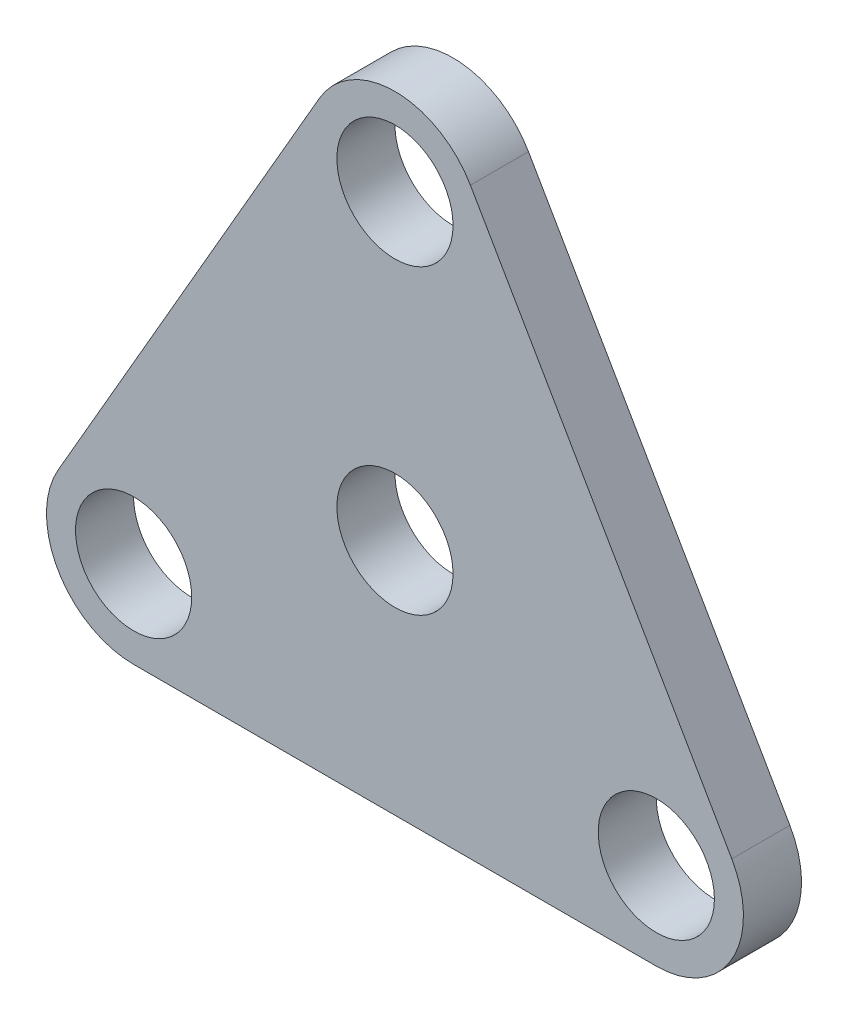
ISO-10303-21;
HEADER;
FILE_DESCRIPTION(('STEP AP214'),'2;1');
FILE_NAME('part.step','',(''),(''),'','','');
FILE_SCHEMA(('AUTOMOTIVE_DESIGN { 1 0 10303 214 1 1 1 1 }'));
ENDSEC;
DATA;
#1=APPLICATION_CONTEXT('core data for automotive mechanical design processes');
#2=APPLICATION_PROTOCOL_DEFINITION('international standard','automotive_design',2000,#1);
#3=PRODUCT_CONTEXT('',#1,'mechanical');
#4=PRODUCT('Part','Part','',(#3));
#5=PRODUCT_RELATED_PRODUCT_CATEGORY('part','',(#4));
#6=PRODUCT_DEFINITION_FORMATION('','',#4);
#7=PRODUCT_DEFINITION_CONTEXT('part definition',#1,'design');
#8=PRODUCT_DEFINITION('design','',#6,#7);
#9=PRODUCT_DEFINITION_SHAPE('','',#8);
#10=(LENGTH_UNIT() NAMED_UNIT(*) SI_UNIT(.MILLI.,.METRE.));
#11=(NAMED_UNIT(*) PLANE_ANGLE_UNIT() SI_UNIT($,.RADIAN.));
#12=(NAMED_UNIT(*) SI_UNIT($,.STERADIAN.) SOLID_ANGLE_UNIT());
#13=UNCERTAINTY_MEASURE_WITH_UNIT(LENGTH_MEASURE(1.E-05),#10,'distance_accuracy_value','');
#14=(GEOMETRIC_REPRESENTATION_CONTEXT(3) GLOBAL_UNCERTAINTY_ASSIGNED_CONTEXT((#13)) GLOBAL_UNIT_ASSIGNED_CONTEXT((#10,
#11,#12)) REPRESENTATION_CONTEXT('',''));
#15=CARTESIAN_POINT('',(0.,0.,0.));
#16=DIRECTION('',(0.,0.,1.));
#17=DIRECTION('',(1.,0.,0.));
#18=AXIS2_PLACEMENT_3D('',#15,#16,#17);
#19=CARTESIAN_POINT('',(0.,32.9955678841871,6.35));
#20=DIRECTION('',(0.,0.,1.));
#21=DIRECTION('',(1.,0.,0.));
#22=AXIS2_PLACEMENT_3D('',#19,#20,#21);
#23=PLANE('',#22);
#24=CARTESIAN_POINT('',(0.,32.9955678841871,6.35));
#25=DIRECTION('',(0.,0.,1.));
#26=DIRECTION('',(1.,0.,0.));
#27=AXIS2_PLACEMENT_3D('',#24,#25,#26);
#28=CIRCLE('',#27,6.35);
#29=CARTESIAN_POINT('',(6.35000000000001,32.9955678841871,6.35));
#30=VERTEX_POINT('',#29);
#31=EDGE_CURVE('E191',#30,#30,#28,.T.);
#32=ORIENTED_EDGE('',*,*,#31,.F.);
#33=EDGE_LOOP('',(#32));
#34=FACE_BOUND('',#33,.T.);
#35=CARTESIAN_POINT('',(0.,0.,6.35));
#36=DIRECTION('',(0.,0.,1.));
#37=DIRECTION('',(1.,0.,0.));
#38=AXIS2_PLACEMENT_3D('',#35,#36,#37);
#39=CIRCLE('',#38,6.35);
#40=CARTESIAN_POINT('',(6.35,0.,6.35));
#41=VERTEX_POINT('',#40);
#42=EDGE_CURVE('E124',#41,#41,#39,.T.);
#43=ORIENTED_EDGE('',*,*,#42,.F.);
#44=EDGE_LOOP('',(#43));
#45=FACE_BOUND('',#44,.T.);
#46=CARTESIAN_POINT('',(0.,32.9955678841871,6.35));
#47=DIRECTION('',(0.,0.,1.));
#48=DIRECTION('',(1.,0.,0.));
#49=AXIS2_PLACEMENT_3D('',#46,#47,#48);
#50=CIRCLE('',#49,9.525);
#51=CARTESIAN_POINT('',(8.24889197104678,37.7580678841871,6.35));
#52=VERTEX_POINT('',#51);
#53=CARTESIAN_POINT('',(-8.24889197104676,37.7580678841871,6.35));
#54=VERTEX_POINT('',#53);
#55=EDGE_CURVE('E131',#52,#54,#50,.T.);
#56=ORIENTED_EDGE('',*,*,#55,.T.);
#57=DIRECTION('',(-0.5,-0.866025403784439,0.));
#58=VECTOR('',#57,1.);
#59=CARTESIAN_POINT('',(-8.24889197104676,37.7580678841871,6.35));
#60=LINE('',#59,#58);
#61=CARTESIAN_POINT('',(-36.8238919710468,-11.7352839420936,6.35));
#62=VERTEX_POINT('',#61);
#63=EDGE_CURVE('E89',#54,#62,#60,.T.);
#64=ORIENTED_EDGE('',*,*,#63,.T.);
#65=CARTESIAN_POINT('',(-28.575,-16.4977839420936,6.35));
#66=DIRECTION('',(0.,0.,1.));
#67=DIRECTION('',(1.,0.,0.));
#68=AXIS2_PLACEMENT_3D('',#65,#66,#67);
#69=CIRCLE('',#68,9.525);
#70=CARTESIAN_POINT('',(-28.575,-26.0227839420936,6.35));
#71=VERTEX_POINT('',#70);
#72=EDGE_CURVE('E102',#62,#71,#69,.T.);
#73=ORIENTED_EDGE('',*,*,#72,.T.);
#74=DIRECTION('',(1.,0.,0.));
#75=VECTOR('',#74,1.);
#76=CARTESIAN_POINT('',(-28.575,-26.0227839420936,6.35));
#77=LINE('',#76,#75);
#78=CARTESIAN_POINT('',(28.575,-26.0227839420936,6.35));
#79=VERTEX_POINT('',#78);
#80=EDGE_CURVE('E96',#71,#79,#77,.T.);
#81=ORIENTED_EDGE('',*,*,#80,.T.);
#82=CARTESIAN_POINT('',(28.575,-16.4977839420936,6.35));
#83=DIRECTION('',(0.,0.,1.));
#84=DIRECTION('',(1.,0.,0.));
#85=AXIS2_PLACEMENT_3D('',#82,#83,#84);
#86=CIRCLE('',#85,9.525);
#87=CARTESIAN_POINT('',(36.8238919710468,-11.7352839420936,6.35));
#88=VERTEX_POINT('',#87);
#89=EDGE_CURVE('E100',#79,#88,#86,.T.);
#90=ORIENTED_EDGE('',*,*,#89,.T.);
#91=DIRECTION('',(-0.5,0.866025403784439,0.));
#92=VECTOR('',#91,1.);
#93=CARTESIAN_POINT('',(36.8238919710468,-11.7352839420936,6.35));
#94=LINE('',#93,#92);
#95=EDGE_CURVE('E52',#88,#52,#94,.T.);
#96=ORIENTED_EDGE('',*,*,#95,.T.);
#97=EDGE_LOOP('',(#56,#64,#73,#81,#90,#96));
#98=FACE_BOUND('',#97,.T.);
#99=CARTESIAN_POINT('',(-28.575,-16.4977839420936,6.35));
#100=DIRECTION('',(0.,0.,1.));
#101=DIRECTION('',(1.,0.,0.));
#102=AXIS2_PLACEMENT_3D('',#99,#100,#101);
#103=CIRCLE('',#102,6.35);
#104=CARTESIAN_POINT('',(-22.225,-16.4977839420936,6.35));
#105=VERTEX_POINT('',#104);
#106=EDGE_CURVE('E197',#105,#105,#103,.T.);
#107=ORIENTED_EDGE('',*,*,#106,.F.);
#108=EDGE_LOOP('',(#107));
#109=FACE_BOUND('',#108,.T.);
#110=CARTESIAN_POINT('',(28.575,-16.4977839420936,6.35));
#111=DIRECTION('',(0.,0.,1.));
#112=DIRECTION('',(1.,0.,0.));
#113=AXIS2_PLACEMENT_3D('',#110,#111,#112);
#114=CIRCLE('',#113,6.35);
#115=CARTESIAN_POINT('',(34.925,-16.4977839420936,6.35));
#116=VERTEX_POINT('',#115);
#117=EDGE_CURVE('E182',#116,#116,#114,.T.);
#118=ORIENTED_EDGE('',*,*,#117,.F.);
#119=EDGE_LOOP('',(#118));
#120=FACE_BOUND('',#119,.T.);
#121=ADVANCED_FACE('F35',(#34,#45,#98,#109,#120),#23,.T.);
#122=CARTESIAN_POINT('',(0.,32.9955678841871,0.));
#123=DIRECTION('',(0.,0.,1.));
#124=DIRECTION('',(1.,0.,0.));
#125=AXIS2_PLACEMENT_3D('',#122,#123,#124);
#126=PLANE('',#125);
#127=CARTESIAN_POINT('',(0.,32.9955678841871,0.));
#128=DIRECTION('',(0.,0.,1.));
#129=DIRECTION('',(1.,0.,0.));
#130=AXIS2_PLACEMENT_3D('',#127,#128,#129);
#131=CIRCLE('',#130,9.525);
#132=CARTESIAN_POINT('',(8.24889197104678,37.7580678841871,0.));
#133=VERTEX_POINT('',#132);
#134=CARTESIAN_POINT('',(-8.24889197104676,37.7580678841871,0.));
#135=VERTEX_POINT('',#134);
#136=EDGE_CURVE('E120',#133,#135,#131,.T.);
#137=ORIENTED_EDGE('',*,*,#136,.F.);
#138=DIRECTION('',(-0.5,0.866025403784439,0.));
#139=VECTOR('',#138,1.);
#140=CARTESIAN_POINT('',(36.8238919710468,-11.7352839420936,0.));
#141=LINE('',#140,#139);
#142=CARTESIAN_POINT('',(36.8238919710468,-11.7352839420936,0.));
#143=VERTEX_POINT('',#142);
#144=EDGE_CURVE('E81',#143,#133,#141,.T.);
#145=ORIENTED_EDGE('',*,*,#144,.F.);
#146=CARTESIAN_POINT('',(28.575,-16.4977839420936,0.));
#147=DIRECTION('',(0.,0.,1.));
#148=DIRECTION('',(1.,0.,0.));
#149=AXIS2_PLACEMENT_3D('',#146,#147,#148);
#150=CIRCLE('',#149,9.525);
#151=CARTESIAN_POINT('',(28.575,-26.0227839420936,0.));
#152=VERTEX_POINT('',#151);
#153=EDGE_CURVE('E75',#152,#143,#150,.T.);
#154=ORIENTED_EDGE('',*,*,#153,.F.);
#155=DIRECTION('',(1.,0.,0.));
#156=VECTOR('',#155,1.);
#157=CARTESIAN_POINT('',(-28.575,-26.0227839420936,0.));
#158=LINE('',#157,#156);
#159=CARTESIAN_POINT('',(-28.575,-26.0227839420936,0.));
#160=VERTEX_POINT('',#159);
#161=EDGE_CURVE('E110',#160,#152,#158,.T.);
#162=ORIENTED_EDGE('',*,*,#161,.F.);
#163=CARTESIAN_POINT('',(-28.575,-16.4977839420936,0.));
#164=DIRECTION('',(0.,0.,1.));
#165=DIRECTION('',(1.,0.,0.));
#166=AXIS2_PLACEMENT_3D('',#163,#164,#165);
#167=CIRCLE('',#166,9.525);
#168=CARTESIAN_POINT('',(-36.8238919710468,-11.7352839420936,0.));
#169=VERTEX_POINT('',#168);
#170=EDGE_CURVE('E126',#169,#160,#167,.T.);
#171=ORIENTED_EDGE('',*,*,#170,.F.);
#172=DIRECTION('',(-0.5,-0.866025403784439,0.));
#173=VECTOR('',#172,1.);
#174=CARTESIAN_POINT('',(-8.24889197104676,37.7580678841871,0.));
#175=LINE('',#174,#173);
#176=EDGE_CURVE('E123',#135,#169,#175,.T.);
#177=ORIENTED_EDGE('',*,*,#176,.F.);
#178=EDGE_LOOP('',(#137,#145,#154,#162,#171,#177));
#179=FACE_BOUND('',#178,.T.);
#180=CARTESIAN_POINT('',(0.,0.,0.));
#181=DIRECTION('',(0.,0.,1.));
#182=DIRECTION('',(1.,0.,0.));
#183=AXIS2_PLACEMENT_3D('',#180,#181,#182);
#184=CIRCLE('',#183,6.35);
#185=CARTESIAN_POINT('',(6.35,0.,0.));
#186=VERTEX_POINT('',#185);
#187=EDGE_CURVE('E200',#186,#186,#184,.T.);
#188=ORIENTED_EDGE('',*,*,#187,.T.);
#189=EDGE_LOOP('',(#188));
#190=FACE_BOUND('',#189,.T.);
#191=CARTESIAN_POINT('',(-28.575,-16.4977839420936,0.));
#192=DIRECTION('',(0.,0.,1.));
#193=DIRECTION('',(1.,0.,0.));
#194=AXIS2_PLACEMENT_3D('',#191,#192,#193);
#195=CIRCLE('',#194,6.35);
#196=CARTESIAN_POINT('',(-22.225,-16.4977839420936,0.));
#197=VERTEX_POINT('',#196);
#198=EDGE_CURVE('E194',#197,#197,#195,.T.);
#199=ORIENTED_EDGE('',*,*,#198,.T.);
#200=EDGE_LOOP('',(#199));
#201=FACE_BOUND('',#200,.T.);
#202=CARTESIAN_POINT('',(0.,32.9955678841871,0.));
#203=DIRECTION('',(0.,0.,1.));
#204=DIRECTION('',(1.,0.,0.));
#205=AXIS2_PLACEMENT_3D('',#202,#203,#204);
#206=CIRCLE('',#205,6.35);
#207=CARTESIAN_POINT('',(6.35000000000001,32.9955678841871,0.));
#208=VERTEX_POINT('',#207);
#209=EDGE_CURVE('E188',#208,#208,#206,.T.);
#210=ORIENTED_EDGE('',*,*,#209,.T.);
#211=EDGE_LOOP('',(#210));
#212=FACE_BOUND('',#211,.T.);
#213=CARTESIAN_POINT('',(28.575,-16.4977839420936,0.));
#214=DIRECTION('',(0.,0.,1.));
#215=DIRECTION('',(1.,0.,0.));
#216=AXIS2_PLACEMENT_3D('',#213,#214,#215);
#217=CIRCLE('',#216,6.35);
#218=CARTESIAN_POINT('',(34.925,-16.4977839420936,0.));
#219=VERTEX_POINT('',#218);
#220=EDGE_CURVE('E185',#219,#219,#217,.T.);
#221=ORIENTED_EDGE('',*,*,#220,.T.);
#222=EDGE_LOOP('',(#221));
#223=FACE_BOUND('',#222,.T.);
#224=ADVANCED_FACE('F140',(#179,#190,#201,#212,#223),#126,.F.);
#225=CARTESIAN_POINT('',(0.,32.9955678841871,6.35));
#226=DIRECTION('',(0.,0.,-1.));
#227=DIRECTION('',(-1.,0.,0.));
#228=AXIS2_PLACEMENT_3D('',#225,#226,#227);
#229=CYLINDRICAL_SURFACE('',#228,9.525);
#230=ORIENTED_EDGE('',*,*,#136,.T.);
#231=DIRECTION('',(0.,0.,-1.));
#232=VECTOR('',#231,1.);
#233=CARTESIAN_POINT('',(-8.24889197104676,37.7580678841871,6.35));
#234=LINE('',#233,#232);
#235=EDGE_CURVE('E11',#54,#135,#234,.T.);
#236=ORIENTED_EDGE('',*,*,#235,.F.);
#237=ORIENTED_EDGE('',*,*,#55,.F.);
#238=DIRECTION('',(0.,0.,-1.));
#239=VECTOR('',#238,1.);
#240=CARTESIAN_POINT('',(8.24889197104678,37.7580678841871,6.35));
#241=LINE('',#240,#239);
#242=EDGE_CURVE('E116',#52,#133,#241,.T.);
#243=ORIENTED_EDGE('',*,*,#242,.T.);
#244=EDGE_LOOP('',(#230,#236,#237,#243));
#245=FACE_BOUND('',#244,.T.);
#246=ADVANCED_FACE('F37',(#245),#229,.T.);
#247=CARTESIAN_POINT('',(-8.24889197104676,37.7580678841871,6.35));
#248=DIRECTION('',(0.866025403784439,-0.5,0.));
#249=DIRECTION('',(0.5,0.866025403784439,0.));
#250=AXIS2_PLACEMENT_3D('',#247,#248,#249);
#251=PLANE('',#250);
#252=ORIENTED_EDGE('',*,*,#176,.T.);
#253=DIRECTION('',(0.,0.,-1.));
#254=VECTOR('',#253,1.);
#255=CARTESIAN_POINT('',(-36.8238919710468,-11.7352839420936,6.35));
#256=LINE('',#255,#254);
#257=EDGE_CURVE('E44',#62,#169,#256,.T.);
#258=ORIENTED_EDGE('',*,*,#257,.F.);
#259=ORIENTED_EDGE('',*,*,#63,.F.);
#260=ORIENTED_EDGE('',*,*,#235,.T.);
#261=EDGE_LOOP('',(#252,#258,#259,#260));
#262=FACE_BOUND('',#261,.T.);
#263=ADVANCED_FACE('F258',(#262),#251,.F.);
#264=CARTESIAN_POINT('',(-28.575,-16.4977839420936,6.35));
#265=DIRECTION('',(0.,0.,-1.));
#266=DIRECTION('',(-1.,0.,0.));
#267=AXIS2_PLACEMENT_3D('',#264,#265,#266);
#268=CYLINDRICAL_SURFACE('',#267,9.525);
#269=ORIENTED_EDGE('',*,*,#170,.T.);
#270=DIRECTION('',(0.,0.,-1.));
#271=VECTOR('',#270,1.);
#272=CARTESIAN_POINT('',(-28.575,-26.0227839420936,6.35));
#273=LINE('',#272,#271);
#274=EDGE_CURVE('E111',#71,#160,#273,.T.);
#275=ORIENTED_EDGE('',*,*,#274,.F.);
#276=ORIENTED_EDGE('',*,*,#72,.F.);
#277=ORIENTED_EDGE('',*,*,#257,.T.);
#278=EDGE_LOOP('',(#269,#275,#276,#277));
#279=FACE_BOUND('',#278,.T.);
#280=ADVANCED_FACE('F137',(#279),#268,.T.);
#281=CARTESIAN_POINT('',(-28.575,-26.0227839420936,6.35));
#282=DIRECTION('',(0.,1.,0.));
#283=DIRECTION('',(-1.,0.,0.));
#284=AXIS2_PLACEMENT_3D('',#281,#282,#283);
#285=PLANE('',#284);
#286=ORIENTED_EDGE('',*,*,#161,.T.);
#287=DIRECTION('',(0.,0.,-1.));
#288=VECTOR('',#287,1.);
#289=CARTESIAN_POINT('',(28.575,-26.0227839420936,6.35));
#290=LINE('',#289,#288);
#291=EDGE_CURVE('E107',#79,#152,#290,.T.);
#292=ORIENTED_EDGE('',*,*,#291,.F.);
#293=ORIENTED_EDGE('',*,*,#80,.F.);
#294=ORIENTED_EDGE('',*,*,#274,.T.);
#295=EDGE_LOOP('',(#286,#292,#293,#294));
#296=FACE_BOUND('',#295,.T.);
#297=ADVANCED_FACE('F108',(#296),#285,.F.);
#298=CARTESIAN_POINT('',(28.575,-16.4977839420936,6.35));
#299=DIRECTION('',(0.,0.,-1.));
#300=DIRECTION('',(-1.,0.,0.));
#301=AXIS2_PLACEMENT_3D('',#298,#299,#300);
#302=CYLINDRICAL_SURFACE('',#301,9.525);
#303=ORIENTED_EDGE('',*,*,#153,.T.);
#304=DIRECTION('',(0.,0.,-1.));
#305=VECTOR('',#304,1.);
#306=CARTESIAN_POINT('',(36.8238919710468,-11.7352839420936,6.35));
#307=LINE('',#306,#305);
#308=EDGE_CURVE('E112',#88,#143,#307,.T.);
#309=ORIENTED_EDGE('',*,*,#308,.F.);
#310=ORIENTED_EDGE('',*,*,#89,.F.);
#311=ORIENTED_EDGE('',*,*,#291,.T.);
#312=EDGE_LOOP('',(#303,#309,#310,#311));
#313=FACE_BOUND('',#312,.T.);
#314=ADVANCED_FACE('F114',(#313),#302,.T.);
#315=CARTESIAN_POINT('',(36.8238919710468,-11.7352839420936,6.35));
#316=DIRECTION('',(-0.866025403784439,-0.5,0.));
#317=DIRECTION('',(0.5,-0.866025403784439,0.));
#318=AXIS2_PLACEMENT_3D('',#315,#316,#317);
#319=PLANE('',#318);
#320=ORIENTED_EDGE('',*,*,#144,.T.);
#321=ORIENTED_EDGE('',*,*,#242,.F.);
#322=ORIENTED_EDGE('',*,*,#95,.F.);
#323=ORIENTED_EDGE('',*,*,#308,.T.);
#324=EDGE_LOOP('',(#320,#321,#322,#323));
#325=FACE_BOUND('',#324,.T.);
#326=ADVANCED_FACE('F145',(#325),#319,.F.);
#327=CARTESIAN_POINT('',(0.,0.,6.35));
#328=DIRECTION('',(0.,0.,-1.));
#329=DIRECTION('',(-1.,0.,0.));
#330=AXIS2_PLACEMENT_3D('',#327,#328,#329);
#331=CYLINDRICAL_SURFACE('',#330,6.35);
#332=ORIENTED_EDGE('',*,*,#42,.T.);
#333=EDGE_LOOP('',(#332));
#334=FACE_BOUND('',#333,.T.);
#335=ORIENTED_EDGE('',*,*,#187,.F.);
#336=EDGE_LOOP('',(#335));
#337=FACE_BOUND('',#336,.T.);
#338=ADVANCED_FACE('F147',(#334,#337),#331,.F.);
#339=CARTESIAN_POINT('',(-28.575,-16.4977839420936,6.35));
#340=DIRECTION('',(0.,0.,-1.));
#341=DIRECTION('',(-1.,0.,0.));
#342=AXIS2_PLACEMENT_3D('',#339,#340,#341);
#343=CYLINDRICAL_SURFACE('',#342,6.35);
#344=ORIENTED_EDGE('',*,*,#106,.T.);
#345=EDGE_LOOP('',(#344));
#346=FACE_BOUND('',#345,.T.);
#347=ORIENTED_EDGE('',*,*,#198,.F.);
#348=EDGE_LOOP('',(#347));
#349=FACE_BOUND('',#348,.T.);
#350=ADVANCED_FACE('F153',(#346,#349),#343,.F.);
#351=CARTESIAN_POINT('',(0.,32.9955678841871,6.35));
#352=DIRECTION('',(0.,0.,-1.));
#353=DIRECTION('',(-1.,0.,0.));
#354=AXIS2_PLACEMENT_3D('',#351,#352,#353);
#355=CYLINDRICAL_SURFACE('',#354,6.35);
#356=ORIENTED_EDGE('',*,*,#31,.T.);
#357=EDGE_LOOP('',(#356));
#358=FACE_BOUND('',#357,.T.);
#359=ORIENTED_EDGE('',*,*,#209,.F.);
#360=EDGE_LOOP('',(#359));
#361=FACE_BOUND('',#360,.T.);
#362=ADVANCED_FACE('F169',(#358,#361),#355,.F.);
#363=CARTESIAN_POINT('',(28.575,-16.4977839420936,6.35));
#364=DIRECTION('',(0.,0.,-1.));
#365=DIRECTION('',(-1.,0.,0.));
#366=AXIS2_PLACEMENT_3D('',#363,#364,#365);
#367=CYLINDRICAL_SURFACE('',#366,6.35);
#368=ORIENTED_EDGE('',*,*,#117,.T.);
#369=EDGE_LOOP('',(#368));
#370=FACE_BOUND('',#369,.T.);
#371=ORIENTED_EDGE('',*,*,#220,.F.);
#372=EDGE_LOOP('',(#371));
#373=FACE_BOUND('',#372,.T.);
#374=ADVANCED_FACE('F173',(#370,#373),#367,.F.);
#375=CLOSED_SHELL('',(#121,#224,#246,#263,#280,#297,#314,#326,#338,#350,#362,#374));
#376=MANIFOLD_SOLID_BREP('B2',#375);
#377=ADVANCED_BREP_SHAPE_REPRESENTATION('',(#18,#376),#14);
#378=SHAPE_DEFINITION_REPRESENTATION(#9,#377);
ENDSEC;
END-ISO-10303-21;
